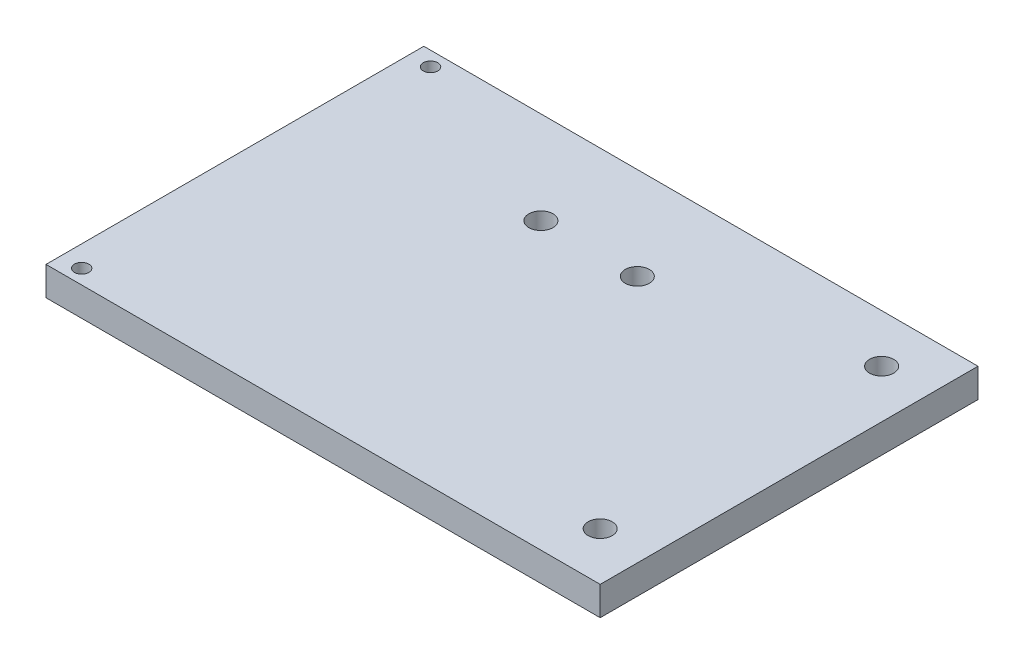
ISO-10303-21;
HEADER;
FILE_DESCRIPTION(('STEP AP214'),'2;1');
FILE_NAME('part.step','',(''),(''),'','','');
FILE_SCHEMA(('AUTOMOTIVE_DESIGN { 1 0 10303 214 1 1 1 1 }'));
ENDSEC;
DATA;
#1=APPLICATION_CONTEXT('core data for automotive mechanical design processes');
#2=APPLICATION_PROTOCOL_DEFINITION('international standard','automotive_design',2000,#1);
#3=PRODUCT_CONTEXT('',#1,'mechanical');
#4=PRODUCT('Part','Part','',(#3));
#5=PRODUCT_RELATED_PRODUCT_CATEGORY('part','',(#4));
#6=PRODUCT_DEFINITION_FORMATION('','',#4);
#7=PRODUCT_DEFINITION_CONTEXT('part definition',#1,'design');
#8=PRODUCT_DEFINITION('design','',#6,#7);
#9=PRODUCT_DEFINITION_SHAPE('','',#8);
#10=(LENGTH_UNIT() NAMED_UNIT(*) SI_UNIT(.MILLI.,.METRE.));
#11=(NAMED_UNIT(*) PLANE_ANGLE_UNIT() SI_UNIT($,.RADIAN.));
#12=(NAMED_UNIT(*) SI_UNIT($,.STERADIAN.) SOLID_ANGLE_UNIT());
#13=UNCERTAINTY_MEASURE_WITH_UNIT(LENGTH_MEASURE(1.E-05),#10,'distance_accuracy_value','');
#14=(GEOMETRIC_REPRESENTATION_CONTEXT(3) GLOBAL_UNCERTAINTY_ASSIGNED_CONTEXT((#13)) GLOBAL_UNIT_ASSIGNED_CONTEXT((#10,
#11,#12)) REPRESENTATION_CONTEXT('',''));
#15=CARTESIAN_POINT('',(0.,0.,0.));
#16=DIRECTION('',(0.,0.,1.));
#17=DIRECTION('',(1.,0.,0.));
#18=AXIS2_PLACEMENT_3D('',#15,#16,#17);
#19=CARTESIAN_POINT('',(0.,6.,0.));
#20=DIRECTION('',(0.,-1.,0.));
#21=DIRECTION('',(0.,0.,-1.));
#22=AXIS2_PLACEMENT_3D('',#19,#20,#21);
#23=PLANE('',#22);
#24=DIRECTION('',(0.,0.,-1.));
#25=VECTOR('',#24,1.);
#26=CARTESIAN_POINT('',(57.5,6.,39.2));
#27=LINE('',#26,#25);
#28=CARTESIAN_POINT('',(57.5,6.,39.2));
#29=VERTEX_POINT('',#28);
#30=CARTESIAN_POINT('',(57.5,6.,-39.2));
#31=VERTEX_POINT('',#30);
#32=EDGE_CURVE('E85',#29,#31,#27,.T.);
#33=ORIENTED_EDGE('',*,*,#32,.T.);
#34=DIRECTION('',(-1.,0.,0.));
#35=VECTOR('',#34,1.);
#36=CARTESIAN_POINT('',(-57.5,6.,-39.2));
#37=LINE('',#36,#35);
#38=CARTESIAN_POINT('',(-57.5,6.,-39.2));
#39=VERTEX_POINT('',#38);
#40=EDGE_CURVE('E80',#31,#39,#37,.T.);
#41=ORIENTED_EDGE('',*,*,#40,.T.);
#42=DIRECTION('',(0.,0.,1.));
#43=VECTOR('',#42,1.);
#44=CARTESIAN_POINT('',(-57.5,6.,39.2));
#45=LINE('',#44,#43);
#46=CARTESIAN_POINT('',(-57.5,6.,39.2));
#47=VERTEX_POINT('',#46);
#48=EDGE_CURVE('E83',#39,#47,#45,.T.);
#49=ORIENTED_EDGE('',*,*,#48,.T.);
#50=DIRECTION('',(1.,0.,0.));
#51=VECTOR('',#50,1.);
#52=CARTESIAN_POINT('',(-57.5,6.,39.2));
#53=LINE('',#52,#51);
#54=EDGE_CURVE('E50',#47,#29,#53,.T.);
#55=ORIENTED_EDGE('',*,*,#54,.T.);
#56=EDGE_LOOP('',(#33,#41,#49,#55));
#57=FACE_BOUND('',#56,.T.);
#58=CARTESIAN_POINT('',(-53.0994897959184,6.,-36.2));
#59=DIRECTION('',(0.,1.,0.));
#60=DIRECTION('',(0.,0.,1.));
#61=AXIS2_PLACEMENT_3D('',#58,#59,#60);
#62=CIRCLE('',#61,1.5);
#63=CARTESIAN_POINT('',(-53.0994897959184,6.,-34.7));
#64=VERTEX_POINT('',#63);
#65=EDGE_CURVE('E100',#64,#64,#62,.T.);
#66=ORIENTED_EDGE('',*,*,#65,.F.);
#67=EDGE_LOOP('',(#66));
#68=FACE_BOUND('',#67,.T.);
#69=CARTESIAN_POINT('',(-53.0994897959184,6.,36.2));
#70=DIRECTION('',(0.,1.,0.));
#71=DIRECTION('',(0.,0.,1.));
#72=AXIS2_PLACEMENT_3D('',#69,#70,#71);
#73=CIRCLE('',#72,1.5);
#74=CARTESIAN_POINT('',(-53.0994897959184,6.,37.7));
#75=VERTEX_POINT('',#74);
#76=EDGE_CURVE('E115',#75,#75,#73,.T.);
#77=ORIENTED_EDGE('',*,*,#76,.F.);
#78=EDGE_LOOP('',(#77));
#79=FACE_BOUND('',#78,.T.);
#80=CARTESIAN_POINT('',(47.5,6.,-29.2));
#81=DIRECTION('',(0.,1.,0.));
#82=DIRECTION('',(0.,0.,1.));
#83=AXIS2_PLACEMENT_3D('',#80,#81,#82);
#84=CIRCLE('',#83,2.49999999999999);
#85=CARTESIAN_POINT('',(47.5,6.,-26.7));
#86=VERTEX_POINT('',#85);
#87=EDGE_CURVE('E121',#86,#86,#84,.T.);
#88=ORIENTED_EDGE('',*,*,#87,.F.);
#89=EDGE_LOOP('',(#88));
#90=FACE_BOUND('',#89,.T.);
#91=CARTESIAN_POINT('',(47.5,6.,29.2));
#92=DIRECTION('',(0.,1.,0.));
#93=DIRECTION('',(0.,0.,1.));
#94=AXIS2_PLACEMENT_3D('',#91,#92,#93);
#95=CIRCLE('',#94,2.49999999999999);
#96=CARTESIAN_POINT('',(47.5,6.,31.7));
#97=VERTEX_POINT('',#96);
#98=EDGE_CURVE('E127',#97,#97,#95,.T.);
#99=ORIENTED_EDGE('',*,*,#98,.F.);
#100=EDGE_LOOP('',(#99));
#101=FACE_BOUND('',#100,.T.);
#102=CARTESIAN_POINT('',(6.,6.,-20.));
#103=DIRECTION('',(0.,1.,0.));
#104=DIRECTION('',(0.,0.,1.));
#105=AXIS2_PLACEMENT_3D('',#102,#103,#104);
#106=CIRCLE('',#105,2.5);
#107=CARTESIAN_POINT('',(6.,6.,-17.5));
#108=VERTEX_POINT('',#107);
#109=EDGE_CURVE('E133',#108,#108,#106,.T.);
#110=ORIENTED_EDGE('',*,*,#109,.F.);
#111=EDGE_LOOP('',(#110));
#112=FACE_BOUND('',#111,.T.);
#113=CARTESIAN_POINT('',(-14.,6.,-20.));
#114=DIRECTION('',(0.,1.,0.));
#115=DIRECTION('',(0.,0.,1.));
#116=AXIS2_PLACEMENT_3D('',#113,#114,#115);
#117=CIRCLE('',#116,2.49999999999999);
#118=CARTESIAN_POINT('',(-14.,6.,-17.5));
#119=VERTEX_POINT('',#118);
#120=EDGE_CURVE('E139',#119,#119,#117,.T.);
#121=ORIENTED_EDGE('',*,*,#120,.F.);
#122=EDGE_LOOP('',(#121));
#123=FACE_BOUND('',#122,.T.);
#124=ADVANCED_FACE('F33',(#57,#68,#79,#90,#101,#112,#123),#23,.F.);
#125=CARTESIAN_POINT('',(0.,0.,0.));
#126=DIRECTION('',(0.,-1.,0.));
#127=DIRECTION('',(0.,0.,-1.));
#128=AXIS2_PLACEMENT_3D('',#125,#126,#127);
#129=PLANE('',#128);
#130=CARTESIAN_POINT('',(6.,0.,-20.));
#131=DIRECTION('',(0.,1.,0.));
#132=DIRECTION('',(0.,0.,1.));
#133=AXIS2_PLACEMENT_3D('',#130,#131,#132);
#134=CIRCLE('',#133,2.5);
#135=CARTESIAN_POINT('',(6.,0.,-17.5));
#136=VERTEX_POINT('',#135);
#137=EDGE_CURVE('E136',#136,#136,#134,.T.);
#138=ORIENTED_EDGE('',*,*,#137,.T.);
#139=EDGE_LOOP('',(#138));
#140=FACE_BOUND('',#139,.T.);
#141=CARTESIAN_POINT('',(47.5,0.,-29.2));
#142=DIRECTION('',(0.,1.,0.));
#143=DIRECTION('',(0.,0.,1.));
#144=AXIS2_PLACEMENT_3D('',#141,#142,#143);
#145=CIRCLE('',#144,2.49999999999999);
#146=CARTESIAN_POINT('',(47.5,0.,-26.7));
#147=VERTEX_POINT('',#146);
#148=EDGE_CURVE('E124',#147,#147,#145,.T.);
#149=ORIENTED_EDGE('',*,*,#148,.T.);
#150=EDGE_LOOP('',(#149));
#151=FACE_BOUND('',#150,.T.);
#152=CARTESIAN_POINT('',(-53.0994897959184,0.,-36.2));
#153=DIRECTION('',(0.,1.,0.));
#154=DIRECTION('',(0.,0.,1.));
#155=AXIS2_PLACEMENT_3D('',#152,#153,#154);
#156=CIRCLE('',#155,1.5);
#157=CARTESIAN_POINT('',(-53.0994897959184,0.,-34.7));
#158=VERTEX_POINT('',#157);
#159=EDGE_CURVE('E112',#158,#158,#156,.T.);
#160=ORIENTED_EDGE('',*,*,#159,.T.);
#161=EDGE_LOOP('',(#160));
#162=FACE_BOUND('',#161,.T.);
#163=DIRECTION('',(0.,0.,-1.));
#164=VECTOR('',#163,1.);
#165=CARTESIAN_POINT('',(57.5,0.,39.2));
#166=LINE('',#165,#164);
#167=CARTESIAN_POINT('',(57.5,0.,39.2));
#168=VERTEX_POINT('',#167);
#169=CARTESIAN_POINT('',(57.5,0.,-39.2));
#170=VERTEX_POINT('',#169);
#171=EDGE_CURVE('E97',#168,#170,#166,.T.);
#172=ORIENTED_EDGE('',*,*,#171,.F.);
#173=DIRECTION('',(1.,0.,0.));
#174=VECTOR('',#173,1.);
#175=CARTESIAN_POINT('',(-57.5,0.,39.2));
#176=LINE('',#175,#174);
#177=CARTESIAN_POINT('',(-57.5,0.,39.2));
#178=VERTEX_POINT('',#177);
#179=EDGE_CURVE('E73',#178,#168,#176,.T.);
#180=ORIENTED_EDGE('',*,*,#179,.F.);
#181=DIRECTION('',(0.,0.,1.));
#182=VECTOR('',#181,1.);
#183=CARTESIAN_POINT('',(-57.5,0.,39.2));
#184=LINE('',#183,#182);
#185=CARTESIAN_POINT('',(-57.5,0.,-39.2));
#186=VERTEX_POINT('',#185);
#187=EDGE_CURVE('E67',#186,#178,#184,.T.);
#188=ORIENTED_EDGE('',*,*,#187,.F.);
#189=DIRECTION('',(-1.,0.,0.));
#190=VECTOR('',#189,1.);
#191=CARTESIAN_POINT('',(-57.5,0.,-39.2));
#192=LINE('',#191,#190);
#193=EDGE_CURVE('E89',#170,#186,#192,.T.);
#194=ORIENTED_EDGE('',*,*,#193,.F.);
#195=EDGE_LOOP('',(#172,#180,#188,#194));
#196=FACE_BOUND('',#195,.T.);
#197=CARTESIAN_POINT('',(-53.0994897959184,0.,36.2));
#198=DIRECTION('',(0.,1.,0.));
#199=DIRECTION('',(0.,0.,1.));
#200=AXIS2_PLACEMENT_3D('',#197,#198,#199);
#201=CIRCLE('',#200,1.5);
#202=CARTESIAN_POINT('',(-53.0994897959184,0.,37.7));
#203=VERTEX_POINT('',#202);
#204=EDGE_CURVE('E118',#203,#203,#201,.T.);
#205=ORIENTED_EDGE('',*,*,#204,.T.);
#206=EDGE_LOOP('',(#205));
#207=FACE_BOUND('',#206,.T.);
#208=CARTESIAN_POINT('',(47.5,0.,29.2));
#209=DIRECTION('',(0.,1.,0.));
#210=DIRECTION('',(0.,0.,1.));
#211=AXIS2_PLACEMENT_3D('',#208,#209,#210);
#212=CIRCLE('',#211,2.49999999999999);
#213=CARTESIAN_POINT('',(47.5,0.,31.7));
#214=VERTEX_POINT('',#213);
#215=EDGE_CURVE('E130',#214,#214,#212,.T.);
#216=ORIENTED_EDGE('',*,*,#215,.T.);
#217=EDGE_LOOP('',(#216));
#218=FACE_BOUND('',#217,.T.);
#219=CARTESIAN_POINT('',(-14.,0.,-20.));
#220=DIRECTION('',(0.,1.,0.));
#221=DIRECTION('',(0.,0.,1.));
#222=AXIS2_PLACEMENT_3D('',#219,#220,#221);
#223=CIRCLE('',#222,2.49999999999999);
#224=CARTESIAN_POINT('',(-14.,0.,-17.5));
#225=VERTEX_POINT('',#224);
#226=EDGE_CURVE('E142',#225,#225,#223,.T.);
#227=ORIENTED_EDGE('',*,*,#226,.T.);
#228=EDGE_LOOP('',(#227));
#229=FACE_BOUND('',#228,.T.);
#230=ADVANCED_FACE('F108',(#140,#151,#162,#196,#207,#218,#229),#129,.T.);
#231=CARTESIAN_POINT('',(57.5,6.,39.2));
#232=DIRECTION('',(-1.,0.,0.));
#233=DIRECTION('',(0.,0.,1.));
#234=AXIS2_PLACEMENT_3D('',#231,#232,#233);
#235=PLANE('',#234);
#236=ORIENTED_EDGE('',*,*,#171,.T.);
#237=DIRECTION('',(0.,-1.,0.));
#238=VECTOR('',#237,1.);
#239=CARTESIAN_POINT('',(57.5,6.,-39.2));
#240=LINE('',#239,#238);
#241=EDGE_CURVE('E11',#31,#170,#240,.T.);
#242=ORIENTED_EDGE('',*,*,#241,.F.);
#243=ORIENTED_EDGE('',*,*,#32,.F.);
#244=DIRECTION('',(0.,-1.,0.));
#245=VECTOR('',#244,1.);
#246=CARTESIAN_POINT('',(57.5,6.,39.2));
#247=LINE('',#246,#245);
#248=EDGE_CURVE('E93',#29,#168,#247,.T.);
#249=ORIENTED_EDGE('',*,*,#248,.T.);
#250=EDGE_LOOP('',(#236,#242,#243,#249));
#251=FACE_BOUND('',#250,.T.);
#252=ADVANCED_FACE('F35',(#251),#235,.F.);
#253=CARTESIAN_POINT('',(-57.5,6.,-39.2));
#254=DIRECTION('',(0.,0.,1.));
#255=DIRECTION('',(1.,0.,0.));
#256=AXIS2_PLACEMENT_3D('',#253,#254,#255);
#257=PLANE('',#256);
#258=ORIENTED_EDGE('',*,*,#193,.T.);
#259=DIRECTION('',(0.,-1.,0.));
#260=VECTOR('',#259,1.);
#261=CARTESIAN_POINT('',(-57.5,6.,-39.2));
#262=LINE('',#261,#260);
#263=EDGE_CURVE('E42',#39,#186,#262,.T.);
#264=ORIENTED_EDGE('',*,*,#263,.F.);
#265=ORIENTED_EDGE('',*,*,#40,.F.);
#266=ORIENTED_EDGE('',*,*,#241,.T.);
#267=EDGE_LOOP('',(#258,#264,#265,#266));
#268=FACE_BOUND('',#267,.T.);
#269=ADVANCED_FACE('F88',(#268),#257,.F.);
#270=CARTESIAN_POINT('',(-57.5,6.,39.2));
#271=DIRECTION('',(1.,0.,0.));
#272=DIRECTION('',(0.,0.,-1.));
#273=AXIS2_PLACEMENT_3D('',#270,#271,#272);
#274=PLANE('',#273);
#275=ORIENTED_EDGE('',*,*,#187,.T.);
#276=DIRECTION('',(0.,-1.,0.));
#277=VECTOR('',#276,1.);
#278=CARTESIAN_POINT('',(-57.5,6.,39.2));
#279=LINE('',#278,#277);
#280=EDGE_CURVE('E90',#47,#178,#279,.T.);
#281=ORIENTED_EDGE('',*,*,#280,.F.);
#282=ORIENTED_EDGE('',*,*,#48,.F.);
#283=ORIENTED_EDGE('',*,*,#263,.T.);
#284=EDGE_LOOP('',(#275,#281,#282,#283));
#285=FACE_BOUND('',#284,.T.);
#286=ADVANCED_FACE('F91',(#285),#274,.F.);
#287=CARTESIAN_POINT('',(-57.5,6.,39.2));
#288=DIRECTION('',(0.,0.,-1.));
#289=DIRECTION('',(-1.,0.,0.));
#290=AXIS2_PLACEMENT_3D('',#287,#288,#289);
#291=PLANE('',#290);
#292=ORIENTED_EDGE('',*,*,#179,.T.);
#293=ORIENTED_EDGE('',*,*,#248,.F.);
#294=ORIENTED_EDGE('',*,*,#54,.F.);
#295=ORIENTED_EDGE('',*,*,#280,.T.);
#296=EDGE_LOOP('',(#292,#293,#294,#295));
#297=FACE_BOUND('',#296,.T.);
#298=ADVANCED_FACE('F105',(#297),#291,.F.);
#299=CARTESIAN_POINT('',(-53.0994897959184,6.,-36.2));
#300=DIRECTION('',(0.,-1.,0.));
#301=DIRECTION('',(0.,0.,-1.));
#302=AXIS2_PLACEMENT_3D('',#299,#300,#301);
#303=CYLINDRICAL_SURFACE('',#302,1.5);
#304=ORIENTED_EDGE('',*,*,#65,.T.);
#305=EDGE_LOOP('',(#304));
#306=FACE_BOUND('',#305,.T.);
#307=ORIENTED_EDGE('',*,*,#159,.F.);
#308=EDGE_LOOP('',(#307));
#309=FACE_BOUND('',#308,.T.);
#310=ADVANCED_FACE('F159',(#306,#309),#303,.F.);
#311=CARTESIAN_POINT('',(-53.0994897959184,6.,36.2));
#312=DIRECTION('',(0.,-1.,0.));
#313=DIRECTION('',(0.,0.,-1.));
#314=AXIS2_PLACEMENT_3D('',#311,#312,#313);
#315=CYLINDRICAL_SURFACE('',#314,1.5);
#316=ORIENTED_EDGE('',*,*,#76,.T.);
#317=EDGE_LOOP('',(#316));
#318=FACE_BOUND('',#317,.T.);
#319=ORIENTED_EDGE('',*,*,#204,.F.);
#320=EDGE_LOOP('',(#319));
#321=FACE_BOUND('',#320,.T.);
#322=ADVANCED_FACE('F205',(#318,#321),#315,.F.);
#323=CARTESIAN_POINT('',(47.5,6.,-29.2));
#324=DIRECTION('',(0.,-1.,0.));
#325=DIRECTION('',(0.,0.,-1.));
#326=AXIS2_PLACEMENT_3D('',#323,#324,#325);
#327=CYLINDRICAL_SURFACE('',#326,2.49999999999999);
#328=ORIENTED_EDGE('',*,*,#87,.T.);
#329=EDGE_LOOP('',(#328));
#330=FACE_BOUND('',#329,.T.);
#331=ORIENTED_EDGE('',*,*,#148,.F.);
#332=EDGE_LOOP('',(#331));
#333=FACE_BOUND('',#332,.T.);
#334=ADVANCED_FACE('F213',(#330,#333),#327,.F.);
#335=CARTESIAN_POINT('',(47.5,6.,29.2));
#336=DIRECTION('',(0.,-1.,0.));
#337=DIRECTION('',(0.,0.,-1.));
#338=AXIS2_PLACEMENT_3D('',#335,#336,#337);
#339=CYLINDRICAL_SURFACE('',#338,2.49999999999999);
#340=ORIENTED_EDGE('',*,*,#98,.T.);
#341=EDGE_LOOP('',(#340));
#342=FACE_BOUND('',#341,.T.);
#343=ORIENTED_EDGE('',*,*,#215,.F.);
#344=EDGE_LOOP('',(#343));
#345=FACE_BOUND('',#344,.T.);
#346=ADVANCED_FACE('F221',(#342,#345),#339,.F.);
#347=CARTESIAN_POINT('',(6.,6.,-20.));
#348=DIRECTION('',(0.,-1.,0.));
#349=DIRECTION('',(0.,0.,-1.));
#350=AXIS2_PLACEMENT_3D('',#347,#348,#349);
#351=CYLINDRICAL_SURFACE('',#350,2.5);
#352=ORIENTED_EDGE('',*,*,#109,.T.);
#353=EDGE_LOOP('',(#352));
#354=FACE_BOUND('',#353,.T.);
#355=ORIENTED_EDGE('',*,*,#137,.F.);
#356=EDGE_LOOP('',(#355));
#357=FACE_BOUND('',#356,.T.);
#358=ADVANCED_FACE('F230',(#354,#357),#351,.F.);
#359=CARTESIAN_POINT('',(-14.,6.,-20.));
#360=DIRECTION('',(0.,-1.,0.));
#361=DIRECTION('',(0.,0.,-1.));
#362=AXIS2_PLACEMENT_3D('',#359,#360,#361);
#363=CYLINDRICAL_SURFACE('',#362,2.49999999999999);
#364=ORIENTED_EDGE('',*,*,#120,.T.);
#365=EDGE_LOOP('',(#364));
#366=FACE_BOUND('',#365,.T.);
#367=ORIENTED_EDGE('',*,*,#226,.F.);
#368=EDGE_LOOP('',(#367));
#369=FACE_BOUND('',#368,.T.);
#370=ADVANCED_FACE('F148',(#366,#369),#363,.F.);
#371=CLOSED_SHELL('',(#124,#230,#252,#269,#286,#298,#310,#322,#334,#346,#358,#370));
#372=MANIFOLD_SOLID_BREP('B2',#371);
#373=ADVANCED_BREP_SHAPE_REPRESENTATION('',(#18,#372),#14);
#374=SHAPE_DEFINITION_REPRESENTATION(#9,#373);
ENDSEC;
END-ISO-10303-21;
